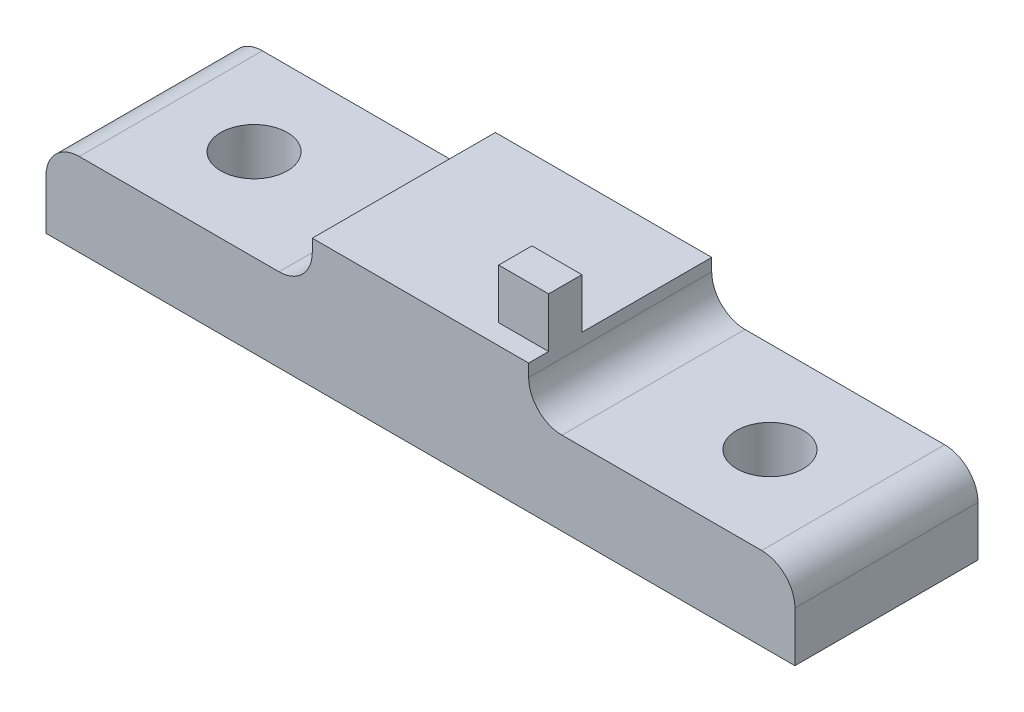
ISO-10303-21;
HEADER;
FILE_DESCRIPTION(('STEP AP214'),'2;1');
FILE_NAME('part.step','',(''),(''),'','','');
FILE_SCHEMA(('AUTOMOTIVE_DESIGN { 1 0 10303 214 1 1 1 1 }'));
ENDSEC;
DATA;
#1=APPLICATION_CONTEXT('core data for automotive mechanical design processes');
#2=APPLICATION_PROTOCOL_DEFINITION('international standard','automotive_design',2000,#1);
#3=PRODUCT_CONTEXT('',#1,'mechanical');
#4=PRODUCT('Part','Part','',(#3));
#5=PRODUCT_RELATED_PRODUCT_CATEGORY('part','',(#4));
#6=PRODUCT_DEFINITION_FORMATION('','',#4);
#7=PRODUCT_DEFINITION_CONTEXT('part definition',#1,'design');
#8=PRODUCT_DEFINITION('design','',#6,#7);
#9=PRODUCT_DEFINITION_SHAPE('','',#8);
#10=(LENGTH_UNIT() NAMED_UNIT(*) SI_UNIT(.MILLI.,.METRE.));
#11=(NAMED_UNIT(*) PLANE_ANGLE_UNIT() SI_UNIT($,.RADIAN.));
#12=(NAMED_UNIT(*) SI_UNIT($,.STERADIAN.) SOLID_ANGLE_UNIT());
#13=UNCERTAINTY_MEASURE_WITH_UNIT(LENGTH_MEASURE(1.E-05),#10,'distance_accuracy_value','');
#14=(GEOMETRIC_REPRESENTATION_CONTEXT(3) GLOBAL_UNCERTAINTY_ASSIGNED_CONTEXT((#13)) GLOBAL_UNIT_ASSIGNED_CONTEXT((#10,
#11,#12)) REPRESENTATION_CONTEXT('',''));
#15=CARTESIAN_POINT('',(0.,0.,0.));
#16=DIRECTION('',(0.,0.,1.));
#17=DIRECTION('',(1.,0.,0.));
#18=AXIS2_PLACEMENT_3D('',#15,#16,#17);
#19=CARTESIAN_POINT('',(-6.5,-7.425,2.));
#20=DIRECTION('',(1.,0.,0.));
#21=DIRECTION('',(0.,0.,-1.));
#22=AXIS2_PLACEMENT_3D('',#19,#20,#21);
#23=PLANE('',#22);
#24=DIRECTION('',(0.,0.,-1.));
#25=VECTOR('',#24,1.);
#26=CARTESIAN_POINT('',(-6.5,-4.425,-4.));
#27=LINE('',#26,#25);
#28=CARTESIAN_POINT('',(-6.5,-4.425,-15.));
#29=VERTEX_POINT('',#28);
#30=CARTESIAN_POINT('',(-6.5,-4.425,-4.));
#31=VERTEX_POINT('',#30);
#32=EDGE_CURVE('E264',#29,#31,#27,.F.);
#33=ORIENTED_EDGE('',*,*,#32,.T.);
#34=DIRECTION('',(0.,1.,0.));
#35=VECTOR('',#34,1.);
#36=CARTESIAN_POINT('',(-6.5,-8.425,-4.));
#37=LINE('',#36,#35);
#38=CARTESIAN_POINT('',(-6.5,-3.675,-4.));
#39=VERTEX_POINT('',#38);
#40=EDGE_CURVE('E217',#31,#39,#37,.T.);
#41=ORIENTED_EDGE('',*,*,#40,.T.);
#42=DIRECTION('',(0.,0.,-1.));
#43=VECTOR('',#42,1.);
#44=CARTESIAN_POINT('',(-6.5,-3.675,15.8406105356664));
#45=LINE('',#44,#43);
#46=CARTESIAN_POINT('',(-6.5,-3.675,-15.));
#47=VERTEX_POINT('',#46);
#48=EDGE_CURVE('E252',#39,#47,#45,.T.);
#49=ORIENTED_EDGE('',*,*,#48,.T.);
#50=DIRECTION('',(0.,1.,0.));
#51=VECTOR('',#50,1.);
#52=CARTESIAN_POINT('',(-6.5,-3.675,-15.));
#53=LINE('',#52,#51);
#54=EDGE_CURVE('E246',#29,#47,#53,.T.);
#55=ORIENTED_EDGE('',*,*,#54,.F.);
#56=EDGE_LOOP('',(#33,#41,#49,#55));
#57=FACE_BOUND('',#56,.T.);
#58=ADVANCED_FACE('F33',(#57),#23,.F.);
#59=CARTESIAN_POINT('',(6.5,-7.425,2.));
#60=DIRECTION('',(-1.,0.,0.));
#61=DIRECTION('',(0.,0.,1.));
#62=AXIS2_PLACEMENT_3D('',#59,#60,#61);
#63=PLANE('',#62);
#64=DIRECTION('',(0.,0.,-1.));
#65=VECTOR('',#64,1.);
#66=CARTESIAN_POINT('',(6.5,-3.675,15.8406105356664));
#67=LINE('',#66,#65);
#68=CARTESIAN_POINT('',(6.5,-3.675,-4.));
#69=VERTEX_POINT('',#68);
#70=CARTESIAN_POINT('',(6.5,-3.675,-5.2));
#71=VERTEX_POINT('',#70);
#72=EDGE_CURVE('E260',#69,#71,#67,.T.);
#73=ORIENTED_EDGE('',*,*,#72,.F.);
#74=DIRECTION('',(0.,1.,0.));
#75=VECTOR('',#74,1.);
#76=CARTESIAN_POINT('',(6.5,-8.425,-4.));
#77=LINE('',#76,#75);
#78=CARTESIAN_POINT('',(6.5,-4.425,-4.));
#79=VERTEX_POINT('',#78);
#80=EDGE_CURVE('E216',#79,#69,#77,.T.);
#81=ORIENTED_EDGE('',*,*,#80,.F.);
#82=DIRECTION('',(0.,0.,1.));
#83=VECTOR('',#82,1.);
#84=CARTESIAN_POINT('',(6.5,-4.425,-15.));
#85=LINE('',#84,#83);
#86=CARTESIAN_POINT('',(6.5,-4.425,-15.));
#87=VERTEX_POINT('',#86);
#88=EDGE_CURVE('E275',#79,#87,#85,.F.);
#89=ORIENTED_EDGE('',*,*,#88,.T.);
#90=DIRECTION('',(0.,-1.,0.));
#91=VECTOR('',#90,1.);
#92=CARTESIAN_POINT('',(6.5,-3.675,-15.));
#93=LINE('',#92,#91);
#94=CARTESIAN_POINT('',(6.5,-3.675,-15.));
#95=VERTEX_POINT('',#94);
#96=EDGE_CURVE('E243',#95,#87,#93,.T.);
#97=ORIENTED_EDGE('',*,*,#96,.F.);
#98=CARTESIAN_POINT('',(6.5,-3.675,-7.2));
#99=VERTEX_POINT('',#98);
#100=EDGE_CURVE('E258',#99,#95,#67,.T.);
#101=ORIENTED_EDGE('',*,*,#100,.F.);
#102=DIRECTION('',(0.,-1.,0.));
#103=VECTOR('',#102,1.);
#104=CARTESIAN_POINT('',(6.5,-0.675,-7.2));
#105=LINE('',#104,#103);
#106=CARTESIAN_POINT('',(6.5,-0.675,-7.2));
#107=VERTEX_POINT('',#106);
#108=EDGE_CURVE('E208',#107,#99,#105,.T.);
#109=ORIENTED_EDGE('',*,*,#108,.F.);
#110=DIRECTION('',(0.,0.,-1.));
#111=VECTOR('',#110,1.);
#112=CARTESIAN_POINT('',(6.5,-0.675,-7.2));
#113=LINE('',#112,#111);
#114=CARTESIAN_POINT('',(6.5,-0.675,-5.2));
#115=VERTEX_POINT('',#114);
#116=EDGE_CURVE('E178',#115,#107,#113,.T.);
#117=ORIENTED_EDGE('',*,*,#116,.F.);
#118=DIRECTION('',(0.,-1.,0.));
#119=VECTOR('',#118,1.);
#120=CARTESIAN_POINT('',(6.5,-0.675,-5.2));
#121=LINE('',#120,#119);
#122=EDGE_CURVE('E187',#115,#71,#121,.T.);
#123=ORIENTED_EDGE('',*,*,#122,.T.);
#124=EDGE_LOOP('',(#73,#81,#89,#97,#101,#109,#117,#123));
#125=FACE_BOUND('',#124,.T.);
#126=ADVANCED_FACE('F312',(#125),#63,.F.);
#127=CARTESIAN_POINT('',(6.5,-3.675,15.8406105356664));
#128=DIRECTION('',(0.,1.,0.));
#129=DIRECTION('',(0.,0.,1.));
#130=AXIS2_PLACEMENT_3D('',#127,#128,#129);
#131=PLANE('',#130);
#132=DIRECTION('',(1.,0.,0.));
#133=VECTOR('',#132,1.);
#134=CARTESIAN_POINT('',(6.5,-3.675,-5.2));
#135=LINE('',#134,#133);
#136=CARTESIAN_POINT('',(3.5,-3.675,-5.2));
#137=VERTEX_POINT('',#136);
#138=EDGE_CURVE('E50',#137,#71,#135,.T.);
#139=ORIENTED_EDGE('',*,*,#138,.F.);
#140=DIRECTION('',(0.,0.,1.));
#141=VECTOR('',#140,1.);
#142=CARTESIAN_POINT('',(3.5,-3.675,-7.2));
#143=LINE('',#142,#141);
#144=CARTESIAN_POINT('',(3.5,-3.675,-7.2));
#145=VERTEX_POINT('',#144);
#146=EDGE_CURVE('E172',#145,#137,#143,.T.);
#147=ORIENTED_EDGE('',*,*,#146,.F.);
#148=DIRECTION('',(-1.,0.,0.));
#149=VECTOR('',#148,1.);
#150=CARTESIAN_POINT('',(6.5,-3.675,-7.2));
#151=LINE('',#150,#149);
#152=EDGE_CURVE('E56',#99,#145,#151,.T.);
#153=ORIENTED_EDGE('',*,*,#152,.F.);
#154=ORIENTED_EDGE('',*,*,#100,.T.);
#155=DIRECTION('',(1.,0.,0.));
#156=VECTOR('',#155,1.);
#157=CARTESIAN_POINT('',(6.5,-3.675,-15.));
#158=LINE('',#157,#156);
#159=EDGE_CURVE('E249',#47,#95,#158,.T.);
#160=ORIENTED_EDGE('',*,*,#159,.F.);
#161=ORIENTED_EDGE('',*,*,#48,.F.);
#162=DIRECTION('',(-1.,0.,0.));
#163=VECTOR('',#162,1.);
#164=CARTESIAN_POINT('',(-6.5,-3.675,-4.));
#165=LINE('',#164,#163);
#166=EDGE_CURVE('E213',#69,#39,#165,.T.);
#167=ORIENTED_EDGE('',*,*,#166,.F.);
#168=ORIENTED_EDGE('',*,*,#72,.T.);
#169=EDGE_LOOP('',(#139,#147,#153,#154,#160,#161,#167,#168));
#170=FACE_BOUND('',#169,.T.);
#171=ADVANCED_FACE('F310',(#170),#131,.T.);
#172=CARTESIAN_POINT('',(0.,0.,-15.));
#173=DIRECTION('',(0.,0.,-1.));
#174=DIRECTION('',(-1.,0.,0.));
#175=AXIS2_PLACEMENT_3D('',#172,#173,#174);
#176=PLANE('',#175);
#177=CARTESIAN_POINT('',(20.5,-8.425,-15.));
#178=DIRECTION('',(0.,0.,-1.));
#179=DIRECTION('',(-1.,0.,0.));
#180=AXIS2_PLACEMENT_3D('',#177,#178,#179);
#181=CIRCLE('',#180,2.);
#182=CARTESIAN_POINT('',(20.5,-6.425,-15.));
#183=VERTEX_POINT('',#182);
#184=CARTESIAN_POINT('',(22.5,-8.425,-15.));
#185=VERTEX_POINT('',#184);
#186=EDGE_CURVE('E287',#183,#185,#181,.T.);
#187=ORIENTED_EDGE('',*,*,#186,.T.);
#188=DIRECTION('',(0.,1.,0.));
#189=VECTOR('',#188,1.);
#190=CARTESIAN_POINT('',(22.5,-11.425,-15.));
#191=LINE('',#190,#189);
#192=CARTESIAN_POINT('',(22.5,-11.425,-15.));
#193=VERTEX_POINT('',#192);
#194=EDGE_CURVE('E152',#193,#185,#191,.T.);
#195=ORIENTED_EDGE('',*,*,#194,.F.);
#196=DIRECTION('',(1.,0.,0.));
#197=VECTOR('',#196,1.);
#198=CARTESIAN_POINT('',(-22.5,-11.425,-15.));
#199=LINE('',#198,#197);
#200=CARTESIAN_POINT('',(-22.5,-11.425,-15.));
#201=VERTEX_POINT('',#200);
#202=EDGE_CURVE('E145',#201,#193,#199,.T.);
#203=ORIENTED_EDGE('',*,*,#202,.F.);
#204=DIRECTION('',(0.,1.,0.));
#205=VECTOR('',#204,1.);
#206=CARTESIAN_POINT('',(-22.5,-11.425,-15.));
#207=LINE('',#206,#205);
#208=CARTESIAN_POINT('',(-22.5,-8.425,-15.));
#209=VERTEX_POINT('',#208);
#210=EDGE_CURVE('E150',#201,#209,#207,.T.);
#211=ORIENTED_EDGE('',*,*,#210,.T.);
#212=CARTESIAN_POINT('',(-20.5,-8.425,-15.));
#213=DIRECTION('',(0.,0.,-1.));
#214=DIRECTION('',(-1.,0.,0.));
#215=AXIS2_PLACEMENT_3D('',#212,#213,#214);
#216=CIRCLE('',#215,2.);
#217=CARTESIAN_POINT('',(-20.5,-6.425,-15.));
#218=VERTEX_POINT('',#217);
#219=EDGE_CURVE('E285',#209,#218,#216,.T.);
#220=ORIENTED_EDGE('',*,*,#219,.T.);
#221=DIRECTION('',(1.,0.,0.));
#222=VECTOR('',#221,1.);
#223=CARTESIAN_POINT('',(-22.5,-6.425,-15.));
#224=LINE('',#223,#222);
#225=CARTESIAN_POINT('',(-8.5,-6.425,-15.));
#226=VERTEX_POINT('',#225);
#227=EDGE_CURVE('E228',#218,#226,#224,.T.);
#228=ORIENTED_EDGE('',*,*,#227,.T.);
#229=CARTESIAN_POINT('',(-8.5,-4.425,-15.));
#230=DIRECTION('',(0.,0.,-1.));
#231=DIRECTION('',(-1.,0.,0.));
#232=AXIS2_PLACEMENT_3D('',#229,#230,#231);
#233=CIRCLE('',#232,2.);
#234=EDGE_CURVE('E42',#226,#29,#233,.F.);
#235=ORIENTED_EDGE('',*,*,#234,.T.);
#236=ORIENTED_EDGE('',*,*,#54,.T.);
#237=ORIENTED_EDGE('',*,*,#159,.T.);
#238=ORIENTED_EDGE('',*,*,#96,.T.);
#239=CARTESIAN_POINT('',(8.5,-4.425,-15.));
#240=DIRECTION('',(0.,0.,-1.));
#241=DIRECTION('',(-1.,0.,0.));
#242=AXIS2_PLACEMENT_3D('',#239,#240,#241);
#243=CIRCLE('',#242,2.);
#244=CARTESIAN_POINT('',(8.5,-6.425,-15.));
#245=VERTEX_POINT('',#244);
#246=EDGE_CURVE('E270',#87,#245,#243,.F.);
#247=ORIENTED_EDGE('',*,*,#246,.T.);
#248=DIRECTION('',(-1.,0.,0.));
#249=VECTOR('',#248,1.);
#250=CARTESIAN_POINT('',(22.5,-6.425,-15.));
#251=LINE('',#250,#249);
#252=EDGE_CURVE('E240',#183,#245,#251,.T.);
#253=ORIENTED_EDGE('',*,*,#252,.F.);
#254=EDGE_LOOP('',(#187,#195,#203,#211,#220,#228,#235,#236,#237,#238,#247,#253));
#255=FACE_BOUND('',#254,.T.);
#256=ADVANCED_FACE('F148',(#255),#176,.T.);
#257=CARTESIAN_POINT('',(22.5,-6.425,-15.));
#258=DIRECTION('',(0.,-1.,0.));
#259=DIRECTION('',(0.,0.,-1.));
#260=AXIS2_PLACEMENT_3D('',#257,#258,#259);
#261=PLANE('',#260);
#262=CARTESIAN_POINT('',(15.5,-6.425,-9.5));
#263=DIRECTION('',(0.,1.,0.));
#264=DIRECTION('',(0.,0.,1.));
#265=AXIS2_PLACEMENT_3D('',#262,#263,#264);
#266=CIRCLE('',#265,2.);
#267=CARTESIAN_POINT('',(15.5,-6.425,-7.5));
#268=VERTEX_POINT('',#267);
#269=EDGE_CURVE('E224',#268,#268,#266,.T.);
#270=ORIENTED_EDGE('',*,*,#269,.F.);
#271=EDGE_LOOP('',(#270));
#272=FACE_BOUND('',#271,.T.);
#273=ORIENTED_EDGE('',*,*,#252,.T.);
#274=DIRECTION('',(0.,0.,1.));
#275=VECTOR('',#274,1.);
#276=CARTESIAN_POINT('',(8.5,-6.425,-4.));
#277=LINE('',#276,#275);
#278=CARTESIAN_POINT('',(8.5,-6.425,-4.));
#279=VERTEX_POINT('',#278);
#280=EDGE_CURVE('E277',#245,#279,#277,.T.);
#281=ORIENTED_EDGE('',*,*,#280,.T.);
#282=DIRECTION('',(-1.,0.,0.));
#283=VECTOR('',#282,1.);
#284=CARTESIAN_POINT('',(22.5,-6.425,-4.));
#285=LINE('',#284,#283);
#286=CARTESIAN_POINT('',(20.5,-6.425,-4.));
#287=VERTEX_POINT('',#286);
#288=EDGE_CURVE('E237',#287,#279,#285,.T.);
#289=ORIENTED_EDGE('',*,*,#288,.F.);
#290=DIRECTION('',(0.,0.,1.));
#291=VECTOR('',#290,1.);
#292=CARTESIAN_POINT('',(20.5,-6.425,-15.));
#293=LINE('',#292,#291);
#294=EDGE_CURVE('E289',#287,#183,#293,.F.);
#295=ORIENTED_EDGE('',*,*,#294,.T.);
#296=EDGE_LOOP('',(#273,#281,#289,#295));
#297=FACE_BOUND('',#296,.T.);
#298=ADVANCED_FACE('F299',(#272,#297),#261,.F.);
#299=CARTESIAN_POINT('',(22.5,-8.425,-4.));
#300=DIRECTION('',(0.,0.,-1.));
#301=DIRECTION('',(-1.,0.,0.));
#302=AXIS2_PLACEMENT_3D('',#299,#300,#301);
#303=PLANE('',#302);
#304=CARTESIAN_POINT('',(-20.5,-8.425,-4.));
#305=DIRECTION('',(0.,0.,-1.));
#306=DIRECTION('',(-1.,0.,0.));
#307=AXIS2_PLACEMENT_3D('',#304,#305,#306);
#308=CIRCLE('',#307,2.);
#309=CARTESIAN_POINT('',(-20.5,-6.425,-4.));
#310=VERTEX_POINT('',#309);
#311=CARTESIAN_POINT('',(-22.5,-8.425,-4.));
#312=VERTEX_POINT('',#311);
#313=EDGE_CURVE('E280',#310,#312,#308,.F.);
#314=ORIENTED_EDGE('',*,*,#313,.T.);
#315=DIRECTION('',(0.,1.,0.));
#316=VECTOR('',#315,1.);
#317=CARTESIAN_POINT('',(-22.5,-11.425,-4.));
#318=LINE('',#317,#316);
#319=CARTESIAN_POINT('',(-22.5,-11.425,-4.));
#320=VERTEX_POINT('',#319);
#321=EDGE_CURVE('E351',#320,#312,#318,.T.);
#322=ORIENTED_EDGE('',*,*,#321,.F.);
#323=DIRECTION('',(-1.,0.,0.));
#324=VECTOR('',#323,1.);
#325=CARTESIAN_POINT('',(-22.5,-11.425,-4.));
#326=LINE('',#325,#324);
#327=CARTESIAN_POINT('',(22.5,-11.425,-4.));
#328=VERTEX_POINT('',#327);
#329=EDGE_CURVE('E162',#328,#320,#326,.T.);
#330=ORIENTED_EDGE('',*,*,#329,.F.);
#331=DIRECTION('',(0.,1.,0.));
#332=VECTOR('',#331,1.);
#333=CARTESIAN_POINT('',(22.5,-11.425,-4.));
#334=LINE('',#333,#332);
#335=CARTESIAN_POINT('',(22.5,-8.425,-4.));
#336=VERTEX_POINT('',#335);
#337=EDGE_CURVE('E174',#328,#336,#334,.T.);
#338=ORIENTED_EDGE('',*,*,#337,.T.);
#339=CARTESIAN_POINT('',(20.5,-8.425,-4.));
#340=DIRECTION('',(0.,0.,-1.));
#341=DIRECTION('',(-1.,0.,0.));
#342=AXIS2_PLACEMENT_3D('',#339,#340,#341);
#343=CIRCLE('',#342,2.);
#344=EDGE_CURVE('E261',#336,#287,#343,.F.);
#345=ORIENTED_EDGE('',*,*,#344,.T.);
#346=ORIENTED_EDGE('',*,*,#288,.T.);
#347=CARTESIAN_POINT('',(8.5,-4.425,-4.));
#348=DIRECTION('',(0.,0.,-1.));
#349=DIRECTION('',(-1.,0.,0.));
#350=AXIS2_PLACEMENT_3D('',#347,#348,#349);
#351=CIRCLE('',#350,2.);
#352=EDGE_CURVE('E272',#279,#79,#351,.T.);
#353=ORIENTED_EDGE('',*,*,#352,.T.);
#354=ORIENTED_EDGE('',*,*,#80,.T.);
#355=ORIENTED_EDGE('',*,*,#166,.T.);
#356=ORIENTED_EDGE('',*,*,#40,.F.);
#357=CARTESIAN_POINT('',(-8.5,-4.425,-4.));
#358=DIRECTION('',(0.,0.,-1.));
#359=DIRECTION('',(-1.,0.,0.));
#360=AXIS2_PLACEMENT_3D('',#357,#358,#359);
#361=CIRCLE('',#360,2.);
#362=CARTESIAN_POINT('',(-8.5,-6.425,-4.));
#363=VERTEX_POINT('',#362);
#364=EDGE_CURVE('E11',#31,#363,#361,.T.);
#365=ORIENTED_EDGE('',*,*,#364,.T.);
#366=DIRECTION('',(1.,0.,0.));
#367=VECTOR('',#366,1.);
#368=CARTESIAN_POINT('',(-22.5,-6.425,-4.));
#369=LINE('',#368,#367);
#370=EDGE_CURVE('E231',#310,#363,#369,.T.);
#371=ORIENTED_EDGE('',*,*,#370,.F.);
#372=EDGE_LOOP('',(#314,#322,#330,#338,#345,#346,#353,#354,#355,#356,#365,#371));
#373=FACE_BOUND('',#372,.T.);
#374=ADVANCED_FACE('F294',(#373),#303,.F.);
#375=CARTESIAN_POINT('',(-22.5,-6.425,-15.));
#376=DIRECTION('',(0.,-1.,0.));
#377=DIRECTION('',(0.,0.,-1.));
#378=AXIS2_PLACEMENT_3D('',#375,#376,#377);
#379=PLANE('',#378);
#380=CARTESIAN_POINT('',(-15.5,-6.425,-9.5));
#381=DIRECTION('',(0.,1.,0.));
#382=DIRECTION('',(0.,0.,1.));
#383=AXIS2_PLACEMENT_3D('',#380,#381,#382);
#384=CIRCLE('',#383,2.);
#385=CARTESIAN_POINT('',(-15.5,-6.425,-7.5));
#386=VERTEX_POINT('',#385);
#387=EDGE_CURVE('E220',#386,#386,#384,.T.);
#388=ORIENTED_EDGE('',*,*,#387,.F.);
#389=EDGE_LOOP('',(#388));
#390=FACE_BOUND('',#389,.T.);
#391=ORIENTED_EDGE('',*,*,#370,.T.);
#392=DIRECTION('',(0.,0.,-1.));
#393=VECTOR('',#392,1.);
#394=CARTESIAN_POINT('',(-8.5,-6.425,-15.));
#395=LINE('',#394,#393);
#396=EDGE_CURVE('E267',#363,#226,#395,.T.);
#397=ORIENTED_EDGE('',*,*,#396,.T.);
#398=ORIENTED_EDGE('',*,*,#227,.F.);
#399=DIRECTION('',(0.,0.,-1.));
#400=VECTOR('',#399,1.);
#401=CARTESIAN_POINT('',(-20.5,-6.425,-15.));
#402=LINE('',#401,#400);
#403=EDGE_CURVE('E283',#218,#310,#402,.F.);
#404=ORIENTED_EDGE('',*,*,#403,.T.);
#405=EDGE_LOOP('',(#391,#397,#398,#404));
#406=FACE_BOUND('',#405,.T.);
#407=ADVANCED_FACE('F348',(#390,#406),#379,.F.);
#408=CARTESIAN_POINT('',(15.5,-8.425,-9.5));
#409=DIRECTION('',(0.,1.,0.));
#410=DIRECTION('',(0.,0.,1.));
#411=AXIS2_PLACEMENT_3D('',#408,#409,#410);
#412=CYLINDRICAL_SURFACE('',#411,2.);
#413=ORIENTED_EDGE('',*,*,#269,.T.);
#414=EDGE_LOOP('',(#413));
#415=FACE_BOUND('',#414,.T.);
#416=CARTESIAN_POINT('',(15.5,-11.425,-9.5));
#417=DIRECTION('',(0.,-1.,0.));
#418=DIRECTION('',(0.,0.,-1.));
#419=AXIS2_PLACEMENT_3D('',#416,#417,#418);
#420=CIRCLE('',#419,2.);
#421=CARTESIAN_POINT('',(15.5,-11.425,-11.5));
#422=VERTEX_POINT('',#421);
#423=EDGE_CURVE('E358',#422,#422,#420,.T.);
#424=ORIENTED_EDGE('',*,*,#423,.T.);
#425=EDGE_LOOP('',(#424));
#426=FACE_BOUND('',#425,.T.);
#427=ADVANCED_FACE('F362',(#415,#426),#412,.F.);
#428=CARTESIAN_POINT('',(-15.5,-8.425,-9.5));
#429=DIRECTION('',(0.,1.,0.));
#430=DIRECTION('',(0.,0.,1.));
#431=AXIS2_PLACEMENT_3D('',#428,#429,#430);
#432=CYLINDRICAL_SURFACE('',#431,2.);
#433=ORIENTED_EDGE('',*,*,#387,.T.);
#434=EDGE_LOOP('',(#433));
#435=FACE_BOUND('',#434,.T.);
#436=CARTESIAN_POINT('',(-15.5,-11.425,-9.5));
#437=DIRECTION('',(0.,-1.,0.));
#438=DIRECTION('',(0.,0.,-1.));
#439=AXIS2_PLACEMENT_3D('',#436,#437,#438);
#440=CIRCLE('',#439,2.);
#441=CARTESIAN_POINT('',(-15.5,-11.425,-11.5));
#442=VERTEX_POINT('',#441);
#443=EDGE_CURVE('E165',#442,#442,#440,.T.);
#444=ORIENTED_EDGE('',*,*,#443,.T.);
#445=EDGE_LOOP('',(#444));
#446=FACE_BOUND('',#445,.T.);
#447=ADVANCED_FACE('F327',(#435,#446),#432,.F.);
#448=CARTESIAN_POINT('',(20.5,-8.425,0.));
#449=DIRECTION('',(0.,0.,-1.));
#450=DIRECTION('',(0.,1.,0.));
#451=AXIS2_PLACEMENT_3D('',#448,#449,#450);
#452=CYLINDRICAL_SURFACE('',#451,2.);
#453=ORIENTED_EDGE('',*,*,#186,.F.);
#454=ORIENTED_EDGE('',*,*,#294,.F.);
#455=ORIENTED_EDGE('',*,*,#344,.F.);
#456=DIRECTION('',(0.,0.,-1.));
#457=VECTOR('',#456,1.);
#458=CARTESIAN_POINT('',(22.5,-8.425,-15.));
#459=LINE('',#458,#457);
#460=EDGE_CURVE('E234',#336,#185,#459,.T.);
#461=ORIENTED_EDGE('',*,*,#460,.T.);
#462=EDGE_LOOP('',(#453,#454,#455,#461));
#463=FACE_BOUND('',#462,.T.);
#464=ADVANCED_FACE('F303',(#463),#452,.T.);
#465=CARTESIAN_POINT('',(-20.5,-8.425,0.));
#466=DIRECTION('',(0.,0.,-1.));
#467=DIRECTION('',(-1.,0.,0.));
#468=AXIS2_PLACEMENT_3D('',#465,#466,#467);
#469=CYLINDRICAL_SURFACE('',#468,2.);
#470=ORIENTED_EDGE('',*,*,#313,.F.);
#471=ORIENTED_EDGE('',*,*,#403,.F.);
#472=ORIENTED_EDGE('',*,*,#219,.F.);
#473=DIRECTION('',(0.,0.,1.));
#474=VECTOR('',#473,1.);
#475=CARTESIAN_POINT('',(-22.5,-8.425,-15.));
#476=LINE('',#475,#474);
#477=EDGE_CURVE('E169',#209,#312,#476,.T.);
#478=ORIENTED_EDGE('',*,*,#477,.T.);
#479=EDGE_LOOP('',(#470,#471,#472,#478));
#480=FACE_BOUND('',#479,.T.);
#481=ADVANCED_FACE('F326',(#480),#469,.T.);
#482=CARTESIAN_POINT('',(8.5,-4.425,-15.));
#483=DIRECTION('',(0.,0.,-1.));
#484=DIRECTION('',(0.,1.,0.));
#485=AXIS2_PLACEMENT_3D('',#482,#483,#484);
#486=CYLINDRICAL_SURFACE('',#485,2.);
#487=ORIENTED_EDGE('',*,*,#246,.F.);
#488=ORIENTED_EDGE('',*,*,#88,.F.);
#489=ORIENTED_EDGE('',*,*,#352,.F.);
#490=ORIENTED_EDGE('',*,*,#280,.F.);
#491=EDGE_LOOP('',(#487,#488,#489,#490));
#492=FACE_BOUND('',#491,.T.);
#493=ADVANCED_FACE('F306',(#492),#486,.F.);
#494=CARTESIAN_POINT('',(-8.5,-4.425,-15.));
#495=DIRECTION('',(0.,0.,1.));
#496=DIRECTION('',(1.,0.,0.));
#497=AXIS2_PLACEMENT_3D('',#494,#495,#496);
#498=CYLINDRICAL_SURFACE('',#497,2.);
#499=ORIENTED_EDGE('',*,*,#364,.F.);
#500=ORIENTED_EDGE('',*,*,#32,.F.);
#501=ORIENTED_EDGE('',*,*,#234,.F.);
#502=ORIENTED_EDGE('',*,*,#396,.F.);
#503=EDGE_LOOP('',(#499,#500,#501,#502));
#504=FACE_BOUND('',#503,.T.);
#505=ADVANCED_FACE('F35',(#504),#498,.F.);
#506=CARTESIAN_POINT('',(6.5,-0.675,-7.2));
#507=DIRECTION('',(0.,0.,1.));
#508=DIRECTION('',(1.,0.,0.));
#509=AXIS2_PLACEMENT_3D('',#506,#507,#508);
#510=PLANE('',#509);
#511=ORIENTED_EDGE('',*,*,#152,.T.);
#512=DIRECTION('',(0.,-1.,0.));
#513=VECTOR('',#512,1.);
#514=CARTESIAN_POINT('',(3.5,-0.675,-7.2));
#515=LINE('',#514,#513);
#516=CARTESIAN_POINT('',(3.5,-0.675,-7.2));
#517=VERTEX_POINT('',#516);
#518=EDGE_CURVE('E203',#517,#145,#515,.T.);
#519=ORIENTED_EDGE('',*,*,#518,.F.);
#520=DIRECTION('',(-1.,0.,0.));
#521=VECTOR('',#520,1.);
#522=CARTESIAN_POINT('',(6.5,-0.675,-7.2));
#523=LINE('',#522,#521);
#524=EDGE_CURVE('E181',#107,#517,#523,.T.);
#525=ORIENTED_EDGE('',*,*,#524,.F.);
#526=ORIENTED_EDGE('',*,*,#108,.T.);
#527=EDGE_LOOP('',(#511,#519,#525,#526));
#528=FACE_BOUND('',#527,.T.);
#529=ADVANCED_FACE('F334',(#528),#510,.F.);
#530=CARTESIAN_POINT('',(3.5,-0.675,-7.2));
#531=DIRECTION('',(1.,0.,0.));
#532=DIRECTION('',(0.,0.,-1.));
#533=AXIS2_PLACEMENT_3D('',#530,#531,#532);
#534=PLANE('',#533);
#535=ORIENTED_EDGE('',*,*,#146,.T.);
#536=DIRECTION('',(0.,-1.,0.));
#537=VECTOR('',#536,1.);
#538=CARTESIAN_POINT('',(3.5,-0.675,-5.2));
#539=LINE('',#538,#537);
#540=CARTESIAN_POINT('',(3.5,-0.675,-5.2));
#541=VERTEX_POINT('',#540);
#542=EDGE_CURVE('E191',#541,#137,#539,.T.);
#543=ORIENTED_EDGE('',*,*,#542,.F.);
#544=DIRECTION('',(0.,0.,1.));
#545=VECTOR('',#544,1.);
#546=CARTESIAN_POINT('',(3.5,-0.675,-7.2));
#547=LINE('',#546,#545);
#548=EDGE_CURVE('E183',#517,#541,#547,.T.);
#549=ORIENTED_EDGE('',*,*,#548,.F.);
#550=ORIENTED_EDGE('',*,*,#518,.T.);
#551=EDGE_LOOP('',(#535,#543,#549,#550));
#552=FACE_BOUND('',#551,.T.);
#553=ADVANCED_FACE('F339',(#552),#534,.F.);
#554=CARTESIAN_POINT('',(6.5,-0.675,-5.2));
#555=DIRECTION('',(0.,0.,-1.));
#556=DIRECTION('',(-1.,0.,0.));
#557=AXIS2_PLACEMENT_3D('',#554,#555,#556);
#558=PLANE('',#557);
#559=ORIENTED_EDGE('',*,*,#138,.T.);
#560=ORIENTED_EDGE('',*,*,#122,.F.);
#561=DIRECTION('',(1.,0.,0.));
#562=VECTOR('',#561,1.);
#563=CARTESIAN_POINT('',(6.5,-0.675,-5.2));
#564=LINE('',#563,#562);
#565=EDGE_CURVE('E185',#541,#115,#564,.T.);
#566=ORIENTED_EDGE('',*,*,#565,.F.);
#567=ORIENTED_EDGE('',*,*,#542,.T.);
#568=EDGE_LOOP('',(#559,#560,#566,#567));
#569=FACE_BOUND('',#568,.T.);
#570=ADVANCED_FACE('F373',(#569),#558,.F.);
#571=CARTESIAN_POINT('',(0.,-0.675,0.));
#572=DIRECTION('',(0.,-1.,0.));
#573=DIRECTION('',(0.,0.,-1.));
#574=AXIS2_PLACEMENT_3D('',#571,#572,#573);
#575=PLANE('',#574);
#576=ORIENTED_EDGE('',*,*,#116,.T.);
#577=ORIENTED_EDGE('',*,*,#524,.T.);
#578=ORIENTED_EDGE('',*,*,#548,.T.);
#579=ORIENTED_EDGE('',*,*,#565,.T.);
#580=EDGE_LOOP('',(#576,#577,#578,#579));
#581=FACE_BOUND('',#580,.T.);
#582=ADVANCED_FACE('F364',(#581),#575,.F.);
#583=CARTESIAN_POINT('',(0.,-11.425,0.));
#584=DIRECTION('',(0.,-1.,0.));
#585=DIRECTION('',(0.,0.,-1.));
#586=AXIS2_PLACEMENT_3D('',#583,#584,#585);
#587=PLANE('',#586);
#588=ORIENTED_EDGE('',*,*,#443,.F.);
#589=EDGE_LOOP('',(#588));
#590=FACE_BOUND('',#589,.T.);
#591=DIRECTION('',(0.,0.,-1.));
#592=VECTOR('',#591,1.);
#593=CARTESIAN_POINT('',(-22.5,-11.425,-4.));
#594=LINE('',#593,#592);
#595=EDGE_CURVE('E156',#320,#201,#594,.T.);
#596=ORIENTED_EDGE('',*,*,#595,.T.);
#597=ORIENTED_EDGE('',*,*,#202,.T.);
#598=DIRECTION('',(0.,0.,1.));
#599=VECTOR('',#598,1.);
#600=CARTESIAN_POINT('',(22.5,-11.425,-4.));
#601=LINE('',#600,#599);
#602=EDGE_CURVE('E155',#193,#328,#601,.T.);
#603=ORIENTED_EDGE('',*,*,#602,.T.);
#604=ORIENTED_EDGE('',*,*,#329,.T.);
#605=EDGE_LOOP('',(#596,#597,#603,#604));
#606=FACE_BOUND('',#605,.T.);
#607=ORIENTED_EDGE('',*,*,#423,.F.);
#608=EDGE_LOOP('',(#607));
#609=FACE_BOUND('',#608,.T.);
#610=ADVANCED_FACE('F159',(#590,#606,#609),#587,.T.);
#611=CARTESIAN_POINT('',(-22.5,-11.425,-4.));
#612=DIRECTION('',(1.,0.,0.));
#613=DIRECTION('',(0.,0.,-1.));
#614=AXIS2_PLACEMENT_3D('',#611,#612,#613);
#615=PLANE('',#614);
#616=ORIENTED_EDGE('',*,*,#477,.F.);
#617=ORIENTED_EDGE('',*,*,#210,.F.);
#618=ORIENTED_EDGE('',*,*,#595,.F.);
#619=ORIENTED_EDGE('',*,*,#321,.T.);
#620=EDGE_LOOP('',(#616,#617,#618,#619));
#621=FACE_BOUND('',#620,.T.);
#622=ADVANCED_FACE('F167',(#621),#615,.F.);
#623=CARTESIAN_POINT('',(22.5,-11.425,-4.));
#624=DIRECTION('',(-1.,0.,0.));
#625=DIRECTION('',(0.,0.,1.));
#626=AXIS2_PLACEMENT_3D('',#623,#624,#625);
#627=PLANE('',#626);
#628=ORIENTED_EDGE('',*,*,#460,.F.);
#629=ORIENTED_EDGE('',*,*,#337,.F.);
#630=ORIENTED_EDGE('',*,*,#602,.F.);
#631=ORIENTED_EDGE('',*,*,#194,.T.);
#632=EDGE_LOOP('',(#628,#629,#630,#631));
#633=FACE_BOUND('',#632,.T.);
#634=ADVANCED_FACE('F371',(#633),#627,.F.);
#635=CLOSED_SHELL('',(#58,#126,#171,#256,#298,#374,#407,#427,#447,#464,#481,#493,#505,#529,#553,
#570,#582,#610,#622,#634));
#636=MANIFOLD_SOLID_BREP('B2',#635);
#637=ADVANCED_BREP_SHAPE_REPRESENTATION('',(#18,#636),#14);
#638=SHAPE_DEFINITION_REPRESENTATION(#9,#637);
ENDSEC;
END-ISO-10303-21;
